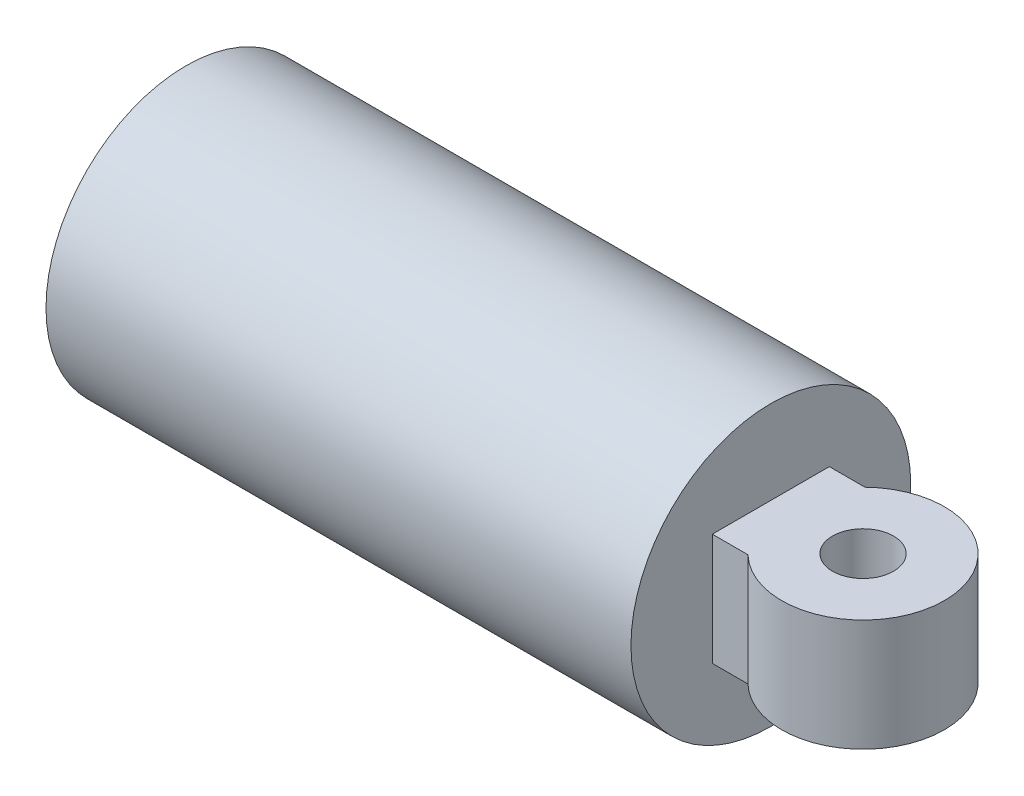
ISO-10303-21;
HEADER;
FILE_DESCRIPTION(('STEP AP214'),'2;1');
FILE_NAME('part.step','',(''),(''),'','','');
FILE_SCHEMA(('AUTOMOTIVE_DESIGN { 1 0 10303 214 1 1 1 1 }'));
ENDSEC;
DATA;
#1=APPLICATION_CONTEXT('core data for automotive mechanical design processes');
#2=APPLICATION_PROTOCOL_DEFINITION('international standard','automotive_design',2000,#1);
#3=PRODUCT_CONTEXT('',#1,'mechanical');
#4=PRODUCT('Part','Part','',(#3));
#5=PRODUCT_RELATED_PRODUCT_CATEGORY('part','',(#4));
#6=PRODUCT_DEFINITION_FORMATION('','',#4);
#7=PRODUCT_DEFINITION_CONTEXT('part definition',#1,'design');
#8=PRODUCT_DEFINITION('design','',#6,#7);
#9=PRODUCT_DEFINITION_SHAPE('','',#8);
#10=(LENGTH_UNIT() NAMED_UNIT(*) SI_UNIT(.MILLI.,.METRE.));
#11=(NAMED_UNIT(*) PLANE_ANGLE_UNIT() SI_UNIT($,.RADIAN.));
#12=(NAMED_UNIT(*) SI_UNIT($,.STERADIAN.) SOLID_ANGLE_UNIT());
#13=UNCERTAINTY_MEASURE_WITH_UNIT(LENGTH_MEASURE(1.E-05),#10,'distance_accuracy_value','');
#14=(GEOMETRIC_REPRESENTATION_CONTEXT(3) GLOBAL_UNCERTAINTY_ASSIGNED_CONTEXT((#13)) GLOBAL_UNIT_ASSIGNED_CONTEXT((#10,
#11,#12)) REPRESENTATION_CONTEXT('',''));
#15=CARTESIAN_POINT('',(0.,0.,0.));
#16=DIRECTION('',(0.,0.,1.));
#17=DIRECTION('',(1.,0.,0.));
#18=AXIS2_PLACEMENT_3D('',#15,#16,#17);
#19=CARTESIAN_POINT('',(0.,0.,-27.5));
#20=DIRECTION('',(-1.,0.,0.));
#21=DIRECTION('',(0.,0.,1.));
#22=AXIS2_PLACEMENT_3D('',#19,#20,#21);
#23=PLANE('',#22);
#24=DIRECTION('',(0.,-1.,0.));
#25=VECTOR('',#24,1.);
#26=CARTESIAN_POINT('',(0.,11.,-11.5));
#27=LINE('',#26,#25);
#28=CARTESIAN_POINT('',(0.,11.,-11.5));
#29=VERTEX_POINT('',#28);
#30=CARTESIAN_POINT('',(0.,-11.,-11.5));
#31=VERTEX_POINT('',#30);
#32=EDGE_CURVE('E98',#29,#31,#27,.T.);
#33=ORIENTED_EDGE('',*,*,#32,.T.);
#34=DIRECTION('',(0.,0.,1.));
#35=VECTOR('',#34,1.);
#36=CARTESIAN_POINT('',(0.,-11.,-11.5));
#37=LINE('',#36,#35);
#38=CARTESIAN_POINT('',(0.,-11.,11.5));
#39=VERTEX_POINT('',#38);
#40=EDGE_CURVE('E47',#31,#39,#37,.T.);
#41=ORIENTED_EDGE('',*,*,#40,.T.);
#42=DIRECTION('',(0.,-1.,0.));
#43=VECTOR('',#42,1.);
#44=CARTESIAN_POINT('',(0.,11.,11.5));
#45=LINE('',#44,#43);
#46=CARTESIAN_POINT('',(0.,11.,11.5));
#47=VERTEX_POINT('',#46);
#48=EDGE_CURVE('E93',#47,#39,#45,.T.);
#49=ORIENTED_EDGE('',*,*,#48,.F.);
#50=DIRECTION('',(0.,0.,1.));
#51=VECTOR('',#50,1.);
#52=CARTESIAN_POINT('',(0.,11.,-11.5));
#53=LINE('',#52,#51);
#54=EDGE_CURVE('E87',#29,#47,#53,.T.);
#55=ORIENTED_EDGE('',*,*,#54,.F.);
#56=EDGE_LOOP('',(#33,#41,#49,#55));
#57=FACE_BOUND('',#56,.T.);
#58=CARTESIAN_POINT('',(0.,0.,0.));
#59=DIRECTION('',(1.,0.,0.));
#60=DIRECTION('',(0.,0.,-1.));
#61=AXIS2_PLACEMENT_3D('',#58,#59,#60);
#62=CIRCLE('',#61,27.5);
#63=CARTESIAN_POINT('',(0.,0.,-27.5));
#64=VERTEX_POINT('',#63);
#65=EDGE_CURVE('E112',#64,#64,#62,.T.);
#66=ORIENTED_EDGE('',*,*,#65,.T.);
#67=EDGE_LOOP('',(#66));
#68=FACE_BOUND('',#67,.T.);
#69=ADVANCED_FACE('F33',(#57,#68),#23,.F.);
#70=CARTESIAN_POINT('',(-13.,0.,0.));
#71=DIRECTION('',(1.,0.,0.));
#72=DIRECTION('',(0.,0.,-1.));
#73=AXIS2_PLACEMENT_3D('',#70,#71,#72);
#74=PLANE('',#73);
#75=CARTESIAN_POINT('',(-13.,0.,0.));
#76=DIRECTION('',(1.,0.,0.));
#77=DIRECTION('',(0.,0.,-1.));
#78=AXIS2_PLACEMENT_3D('',#75,#76,#77);
#79=CIRCLE('',#78,12.5);
#80=CARTESIAN_POINT('',(-13.,0.,-12.5));
#81=VERTEX_POINT('',#80);
#82=EDGE_CURVE('E11',#81,#81,#79,.T.);
#83=ORIENTED_EDGE('',*,*,#82,.F.);
#84=EDGE_LOOP('',(#83));
#85=FACE_BOUND('',#84,.T.);
#86=ADVANCED_FACE('F137',(#85),#74,.F.);
#87=CARTESIAN_POINT('',(0.,0.,0.));
#88=DIRECTION('',(1.,0.,0.));
#89=DIRECTION('',(0.,0.,-1.));
#90=AXIS2_PLACEMENT_3D('',#87,#88,#89);
#91=CYLINDRICAL_SURFACE('',#90,12.5);
#92=CARTESIAN_POINT('',(-113.,0.,0.));
#93=DIRECTION('',(1.,0.,0.));
#94=DIRECTION('',(0.,0.,-1.));
#95=AXIS2_PLACEMENT_3D('',#92,#93,#94);
#96=CIRCLE('',#95,12.5);
#97=CARTESIAN_POINT('',(-113.,0.,-12.5));
#98=VERTEX_POINT('',#97);
#99=EDGE_CURVE('E40',#98,#98,#96,.T.);
#100=ORIENTED_EDGE('',*,*,#99,.F.);
#101=EDGE_LOOP('',(#100));
#102=FACE_BOUND('',#101,.T.);
#103=ORIENTED_EDGE('',*,*,#82,.T.);
#104=EDGE_LOOP('',(#103));
#105=FACE_BOUND('',#104,.T.);
#106=ADVANCED_FACE('F134',(#102,#105),#91,.F.);
#107=CARTESIAN_POINT('',(-113.,0.,-12.5));
#108=DIRECTION('',(1.,0.,0.));
#109=DIRECTION('',(0.,0.,-1.));
#110=AXIS2_PLACEMENT_3D('',#107,#108,#109);
#111=PLANE('',#110);
#112=CARTESIAN_POINT('',(-113.,0.,0.));
#113=DIRECTION('',(1.,0.,0.));
#114=DIRECTION('',(0.,0.,-1.));
#115=AXIS2_PLACEMENT_3D('',#112,#113,#114);
#116=CIRCLE('',#115,14.5);
#117=CARTESIAN_POINT('',(-113.,0.,-14.5));
#118=VERTEX_POINT('',#117);
#119=EDGE_CURVE('E127',#118,#118,#116,.T.);
#120=ORIENTED_EDGE('',*,*,#119,.F.);
#121=EDGE_LOOP('',(#120));
#122=FACE_BOUND('',#121,.T.);
#123=ORIENTED_EDGE('',*,*,#99,.T.);
#124=EDGE_LOOP('',(#123));
#125=FACE_BOUND('',#124,.T.);
#126=ADVANCED_FACE('F132',(#122,#125),#111,.F.);
#127=CARTESIAN_POINT('',(0.,0.,0.));
#128=DIRECTION('',(1.,0.,0.));
#129=DIRECTION('',(0.,0.,-1.));
#130=AXIS2_PLACEMENT_3D('',#127,#128,#129);
#131=CYLINDRICAL_SURFACE('',#130,14.5);
#132=CARTESIAN_POINT('',(-13.,0.,0.));
#133=DIRECTION('',(1.,0.,0.));
#134=DIRECTION('',(0.,0.,-1.));
#135=AXIS2_PLACEMENT_3D('',#132,#133,#134);
#136=CIRCLE('',#135,14.5);
#137=CARTESIAN_POINT('',(-13.,0.,-14.5));
#138=VERTEX_POINT('',#137);
#139=EDGE_CURVE('E124',#138,#138,#136,.T.);
#140=ORIENTED_EDGE('',*,*,#139,.F.);
#141=EDGE_LOOP('',(#140));
#142=FACE_BOUND('',#141,.T.);
#143=ORIENTED_EDGE('',*,*,#119,.T.);
#144=EDGE_LOOP('',(#143));
#145=FACE_BOUND('',#144,.T.);
#146=ADVANCED_FACE('F149',(#142,#145),#131,.T.);
#147=CARTESIAN_POINT('',(-13.,0.,-14.5));
#148=DIRECTION('',(1.,0.,0.));
#149=DIRECTION('',(0.,0.,-1.));
#150=AXIS2_PLACEMENT_3D('',#147,#148,#149);
#151=PLANE('',#150);
#152=CARTESIAN_POINT('',(-13.,0.,0.));
#153=DIRECTION('',(1.,0.,0.));
#154=DIRECTION('',(0.,0.,-1.));
#155=AXIS2_PLACEMENT_3D('',#152,#153,#154);
#156=CIRCLE('',#155,26.5);
#157=CARTESIAN_POINT('',(-13.,0.,-26.5));
#158=VERTEX_POINT('',#157);
#159=EDGE_CURVE('E121',#158,#158,#156,.T.);
#160=ORIENTED_EDGE('',*,*,#159,.F.);
#161=EDGE_LOOP('',(#160));
#162=FACE_BOUND('',#161,.T.);
#163=ORIENTED_EDGE('',*,*,#139,.T.);
#164=EDGE_LOOP('',(#163));
#165=FACE_BOUND('',#164,.T.);
#166=ADVANCED_FACE('F153',(#162,#165),#151,.F.);
#167=CARTESIAN_POINT('',(0.,0.,0.));
#168=DIRECTION('',(1.,0.,0.));
#169=DIRECTION('',(0.,0.,-1.));
#170=AXIS2_PLACEMENT_3D('',#167,#168,#169);
#171=CYLINDRICAL_SURFACE('',#170,26.5);
#172=CARTESIAN_POINT('',(-115.,0.,0.));
#173=DIRECTION('',(1.,0.,0.));
#174=DIRECTION('',(0.,0.,-1.));
#175=AXIS2_PLACEMENT_3D('',#172,#173,#174);
#176=CIRCLE('',#175,26.5);
#177=CARTESIAN_POINT('',(-115.,0.,-26.5));
#178=VERTEX_POINT('',#177);
#179=EDGE_CURVE('E118',#178,#178,#176,.T.);
#180=ORIENTED_EDGE('',*,*,#179,.F.);
#181=EDGE_LOOP('',(#180));
#182=FACE_BOUND('',#181,.T.);
#183=ORIENTED_EDGE('',*,*,#159,.T.);
#184=EDGE_LOOP('',(#183));
#185=FACE_BOUND('',#184,.T.);
#186=ADVANCED_FACE('F157',(#182,#185),#171,.F.);
#187=CARTESIAN_POINT('',(-115.,0.,-26.5));
#188=DIRECTION('',(1.,0.,0.));
#189=DIRECTION('',(0.,0.,-1.));
#190=AXIS2_PLACEMENT_3D('',#187,#188,#189);
#191=PLANE('',#190);
#192=CARTESIAN_POINT('',(-115.,0.,0.));
#193=DIRECTION('',(1.,0.,0.));
#194=DIRECTION('',(0.,0.,-1.));
#195=AXIS2_PLACEMENT_3D('',#192,#193,#194);
#196=CIRCLE('',#195,27.5);
#197=CARTESIAN_POINT('',(-115.,0.,-27.5));
#198=VERTEX_POINT('',#197);
#199=EDGE_CURVE('E115',#198,#198,#196,.T.);
#200=ORIENTED_EDGE('',*,*,#199,.F.);
#201=EDGE_LOOP('',(#200));
#202=FACE_BOUND('',#201,.T.);
#203=ORIENTED_EDGE('',*,*,#179,.T.);
#204=EDGE_LOOP('',(#203));
#205=FACE_BOUND('',#204,.T.);
#206=ADVANCED_FACE('F161',(#202,#205),#191,.F.);
#207=CARTESIAN_POINT('',(0.,0.,0.));
#208=DIRECTION('',(1.,0.,0.));
#209=DIRECTION('',(0.,0.,-1.));
#210=AXIS2_PLACEMENT_3D('',#207,#208,#209);
#211=CYLINDRICAL_SURFACE('',#210,27.5);
#212=ORIENTED_EDGE('',*,*,#65,.F.);
#213=EDGE_LOOP('',(#212));
#214=FACE_BOUND('',#213,.T.);
#215=ORIENTED_EDGE('',*,*,#199,.T.);
#216=EDGE_LOOP('',(#215));
#217=FACE_BOUND('',#216,.T.);
#218=ADVANCED_FACE('F165',(#214,#217),#211,.T.);
#219=CARTESIAN_POINT('',(18.1242977306435,11.,0.));
#220=DIRECTION('',(0.,1.,0.));
#221=DIRECTION('',(0.,0.,1.));
#222=AXIS2_PLACEMENT_3D('',#219,#220,#221);
#223=PLANE('',#222);
#224=ORIENTED_EDGE('',*,*,#54,.T.);
#225=DIRECTION('',(1.,0.,0.));
#226=VECTOR('',#225,1.);
#227=CARTESIAN_POINT('',(0.,11.,11.5));
#228=LINE('',#227,#226);
#229=CARTESIAN_POINT('',(7.,11.,11.5));
#230=VERTEX_POINT('',#229);
#231=EDGE_CURVE('E81',#47,#230,#228,.T.);
#232=ORIENTED_EDGE('',*,*,#231,.T.);
#233=CARTESIAN_POINT('',(18.1242977306435,11.,0.));
#234=DIRECTION('',(0.,1.,0.));
#235=DIRECTION('',(0.,0.,1.));
#236=AXIS2_PLACEMENT_3D('',#233,#234,#235);
#237=CIRCLE('',#236,16.);
#238=CARTESIAN_POINT('',(7.,11.,-11.5));
#239=VERTEX_POINT('',#238);
#240=EDGE_CURVE('E85',#230,#239,#237,.T.);
#241=ORIENTED_EDGE('',*,*,#240,.T.);
#242=DIRECTION('',(-1.,0.,0.));
#243=VECTOR('',#242,1.);
#244=CARTESIAN_POINT('',(0.,11.,-11.5));
#245=LINE('',#244,#243);
#246=EDGE_CURVE('E56',#239,#29,#245,.T.);
#247=ORIENTED_EDGE('',*,*,#246,.T.);
#248=EDGE_LOOP('',(#224,#232,#241,#247));
#249=FACE_BOUND('',#248,.T.);
#250=CARTESIAN_POINT('',(18.1242977306435,11.,0.));
#251=DIRECTION('',(0.,1.,0.));
#252=DIRECTION('',(0.,0.,1.));
#253=AXIS2_PLACEMENT_3D('',#250,#251,#252);
#254=CIRCLE('',#253,6.);
#255=CARTESIAN_POINT('',(18.1242977306435,11.,6.));
#256=VERTEX_POINT('',#255);
#257=EDGE_CURVE('E103',#256,#256,#254,.T.);
#258=ORIENTED_EDGE('',*,*,#257,.F.);
#259=EDGE_LOOP('',(#258));
#260=FACE_BOUND('',#259,.T.);
#261=ADVANCED_FACE('F82',(#249,#260),#223,.T.);
#262=CARTESIAN_POINT('',(18.1242977306435,-11.,0.));
#263=DIRECTION('',(0.,1.,0.));
#264=DIRECTION('',(0.,0.,1.));
#265=AXIS2_PLACEMENT_3D('',#262,#263,#264);
#266=PLANE('',#265);
#267=ORIENTED_EDGE('',*,*,#40,.F.);
#268=DIRECTION('',(-1.,0.,0.));
#269=VECTOR('',#268,1.);
#270=CARTESIAN_POINT('',(0.,-11.,-11.5));
#271=LINE('',#270,#269);
#272=CARTESIAN_POINT('',(7.,-11.,-11.5));
#273=VERTEX_POINT('',#272);
#274=EDGE_CURVE('E106',#273,#31,#271,.T.);
#275=ORIENTED_EDGE('',*,*,#274,.F.);
#276=CARTESIAN_POINT('',(18.1242977306435,-11.,0.));
#277=DIRECTION('',(0.,1.,0.));
#278=DIRECTION('',(0.,0.,1.));
#279=AXIS2_PLACEMENT_3D('',#276,#277,#278);
#280=CIRCLE('',#279,16.);
#281=CARTESIAN_POINT('',(7.,-11.,11.5));
#282=VERTEX_POINT('',#281);
#283=EDGE_CURVE('E73',#282,#273,#280,.T.);
#284=ORIENTED_EDGE('',*,*,#283,.F.);
#285=DIRECTION('',(1.,0.,0.));
#286=VECTOR('',#285,1.);
#287=CARTESIAN_POINT('',(0.,-11.,11.5));
#288=LINE('',#287,#286);
#289=EDGE_CURVE('E92',#39,#282,#288,.T.);
#290=ORIENTED_EDGE('',*,*,#289,.F.);
#291=EDGE_LOOP('',(#267,#275,#284,#290));
#292=FACE_BOUND('',#291,.T.);
#293=CARTESIAN_POINT('',(18.1242977306435,-11.,0.));
#294=DIRECTION('',(0.,1.,0.));
#295=DIRECTION('',(0.,0.,1.));
#296=AXIS2_PLACEMENT_3D('',#293,#294,#295);
#297=CIRCLE('',#296,6.);
#298=CARTESIAN_POINT('',(18.1242977306435,-11.,6.));
#299=VERTEX_POINT('',#298);
#300=EDGE_CURVE('E193',#299,#299,#297,.T.);
#301=ORIENTED_EDGE('',*,*,#300,.T.);
#302=EDGE_LOOP('',(#301));
#303=FACE_BOUND('',#302,.T.);
#304=ADVANCED_FACE('F172',(#292,#303),#266,.F.);
#305=CARTESIAN_POINT('',(0.,11.,11.5));
#306=DIRECTION('',(0.,0.,-1.));
#307=DIRECTION('',(-1.,0.,0.));
#308=AXIS2_PLACEMENT_3D('',#305,#306,#307);
#309=PLANE('',#308);
#310=ORIENTED_EDGE('',*,*,#289,.T.);
#311=DIRECTION('',(0.,-1.,0.));
#312=VECTOR('',#311,1.);
#313=CARTESIAN_POINT('',(7.,11.,11.5));
#314=LINE('',#313,#312);
#315=EDGE_CURVE('E90',#230,#282,#314,.T.);
#316=ORIENTED_EDGE('',*,*,#315,.F.);
#317=ORIENTED_EDGE('',*,*,#231,.F.);
#318=ORIENTED_EDGE('',*,*,#48,.T.);
#319=EDGE_LOOP('',(#310,#316,#317,#318));
#320=FACE_BOUND('',#319,.T.);
#321=ADVANCED_FACE('F91',(#320),#309,.F.);
#322=CARTESIAN_POINT('',(18.1242977306435,11.,0.));
#323=DIRECTION('',(0.,-1.,0.));
#324=DIRECTION('',(0.,0.,-1.));
#325=AXIS2_PLACEMENT_3D('',#322,#323,#324);
#326=CYLINDRICAL_SURFACE('',#325,16.);
#327=ORIENTED_EDGE('',*,*,#283,.T.);
#328=DIRECTION('',(0.,-1.,0.));
#329=VECTOR('',#328,1.);
#330=CARTESIAN_POINT('',(7.,11.,-11.5));
#331=LINE('',#330,#329);
#332=EDGE_CURVE('E94',#239,#273,#331,.T.);
#333=ORIENTED_EDGE('',*,*,#332,.F.);
#334=ORIENTED_EDGE('',*,*,#240,.F.);
#335=ORIENTED_EDGE('',*,*,#315,.T.);
#336=EDGE_LOOP('',(#327,#333,#334,#335));
#337=FACE_BOUND('',#336,.T.);
#338=ADVANCED_FACE('F96',(#337),#326,.T.);
#339=CARTESIAN_POINT('',(0.,11.,-11.5));
#340=DIRECTION('',(0.,0.,1.));
#341=DIRECTION('',(1.,0.,0.));
#342=AXIS2_PLACEMENT_3D('',#339,#340,#341);
#343=PLANE('',#342);
#344=ORIENTED_EDGE('',*,*,#274,.T.);
#345=ORIENTED_EDGE('',*,*,#32,.F.);
#346=ORIENTED_EDGE('',*,*,#246,.F.);
#347=ORIENTED_EDGE('',*,*,#332,.T.);
#348=EDGE_LOOP('',(#344,#345,#346,#347));
#349=FACE_BOUND('',#348,.T.);
#350=ADVANCED_FACE('F175',(#349),#343,.F.);
#351=CARTESIAN_POINT('',(18.1242977306435,11.,0.));
#352=DIRECTION('',(0.,-1.,0.));
#353=DIRECTION('',(0.,0.,-1.));
#354=AXIS2_PLACEMENT_3D('',#351,#352,#353);
#355=CYLINDRICAL_SURFACE('',#354,6.);
#356=ORIENTED_EDGE('',*,*,#257,.T.);
#357=EDGE_LOOP('',(#356));
#358=FACE_BOUND('',#357,.T.);
#359=ORIENTED_EDGE('',*,*,#300,.F.);
#360=EDGE_LOOP('',(#359));
#361=FACE_BOUND('',#360,.T.);
#362=ADVANCED_FACE('F178',(#358,#361),#355,.F.);
#363=CLOSED_SHELL('',(#69,#86,#106,#126,#146,#166,#186,#206,#218,#261,#304,#321,#338,#350,#362));
#364=MANIFOLD_SOLID_BREP('B2',#363);
#365=ADVANCED_BREP_SHAPE_REPRESENTATION('',(#18,#364),#14);
#366=SHAPE_DEFINITION_REPRESENTATION(#9,#365);
ENDSEC;
END-ISO-10303-21;
